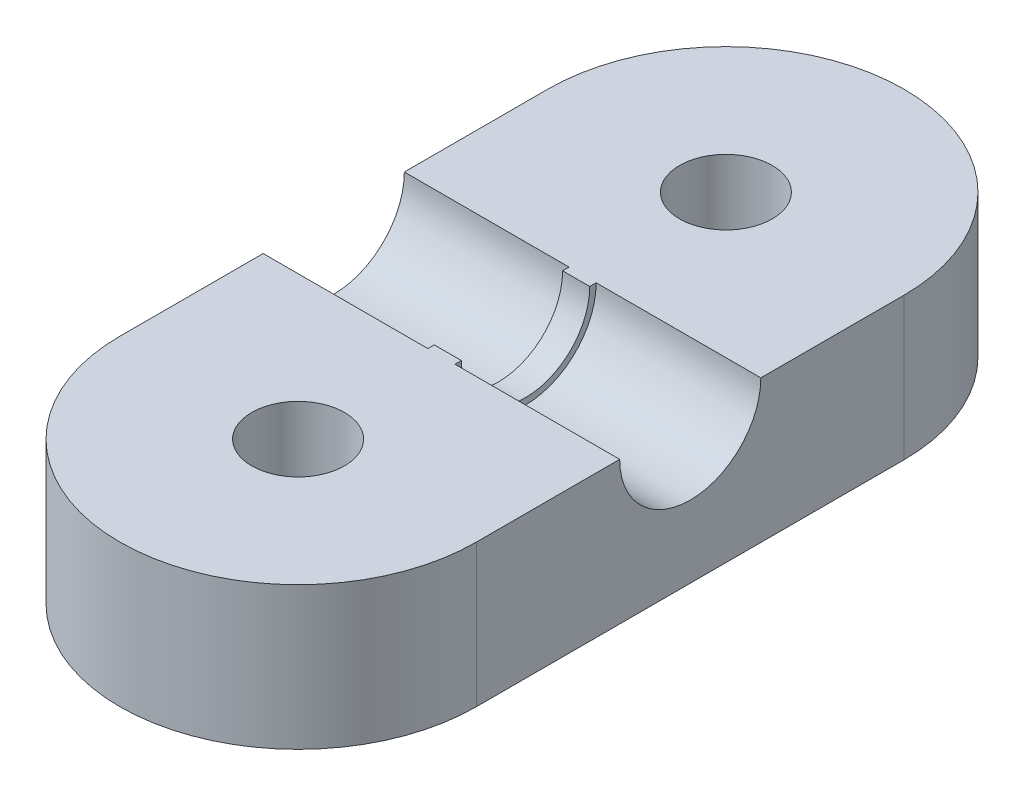
ISO-10303-21;
HEADER;
FILE_DESCRIPTION(('STEP AP214'),'2;1');
FILE_NAME('part.step','',(''),(''),'','','');
FILE_SCHEMA(('AUTOMOTIVE_DESIGN { 1 0 10303 214 1 1 1 1 }'));
ENDSEC;
DATA;
#1=APPLICATION_CONTEXT('core data for automotive mechanical design processes');
#2=APPLICATION_PROTOCOL_DEFINITION('international standard','automotive_design',2000,#1);
#3=PRODUCT_CONTEXT('',#1,'mechanical');
#4=PRODUCT('Part','Part','',(#3));
#5=PRODUCT_RELATED_PRODUCT_CATEGORY('part','',(#4));
#6=PRODUCT_DEFINITION_FORMATION('','',#4);
#7=PRODUCT_DEFINITION_CONTEXT('part definition',#1,'design');
#8=PRODUCT_DEFINITION('design','',#6,#7);
#9=PRODUCT_DEFINITION_SHAPE('','',#8);
#10=(LENGTH_UNIT() NAMED_UNIT(*) SI_UNIT(.MILLI.,.METRE.));
#11=(NAMED_UNIT(*) PLANE_ANGLE_UNIT() SI_UNIT($,.RADIAN.));
#12=(NAMED_UNIT(*) SI_UNIT($,.STERADIAN.) SOLID_ANGLE_UNIT());
#13=UNCERTAINTY_MEASURE_WITH_UNIT(LENGTH_MEASURE(1.E-05),#10,'distance_accuracy_value','');
#14=(GEOMETRIC_REPRESENTATION_CONTEXT(3) GLOBAL_UNCERTAINTY_ASSIGNED_CONTEXT((#13)) GLOBAL_UNIT_ASSIGNED_CONTEXT((#10,
#11,#12)) REPRESENTATION_CONTEXT('',''));
#15=CARTESIAN_POINT('',(0.,0.,0.));
#16=DIRECTION('',(0.,0.,1.));
#17=DIRECTION('',(1.,0.,0.));
#18=AXIS2_PLACEMENT_3D('',#15,#16,#17);
#19=CARTESIAN_POINT('',(-12.501,10.,0.));
#20=DIRECTION('',(1.,0.,0.));
#21=DIRECTION('',(0.,0.,-1.));
#22=AXIS2_PLACEMENT_3D('',#19,#20,#21);
#23=CYLINDRICAL_SURFACE('',#22,4.95);
#24=CARTESIAN_POINT('',(-0.95,10.,0.));
#25=DIRECTION('',(1.,0.,0.));
#26=DIRECTION('',(0.,0.,-1.));
#27=AXIS2_PLACEMENT_3D('',#24,#25,#26);
#28=CIRCLE('',#27,4.95);
#29=CARTESIAN_POINT('',(-0.95,10.,4.95));
#30=VERTEX_POINT('',#29);
#31=CARTESIAN_POINT('',(-0.95,10.,-4.95));
#32=VERTEX_POINT('',#31);
#33=EDGE_CURVE('E177',#30,#32,#28,.T.);
#34=ORIENTED_EDGE('',*,*,#33,.T.);
#35=DIRECTION('',(1.,0.,0.));
#36=VECTOR('',#35,1.);
#37=CARTESIAN_POINT('',(-12.501,10.,-4.95));
#38=LINE('',#37,#36);
#39=CARTESIAN_POINT('',(-12.5,10.,-4.95));
#40=VERTEX_POINT('',#39);
#41=EDGE_CURVE('E180',#40,#32,#38,.T.);
#42=ORIENTED_EDGE('',*,*,#41,.F.);
#43=CARTESIAN_POINT('',(-12.5,10.,0.));
#44=DIRECTION('',(1.,0.,0.));
#45=DIRECTION('',(0.,0.,-1.));
#46=AXIS2_PLACEMENT_3D('',#43,#44,#45);
#47=CIRCLE('',#46,4.95);
#48=CARTESIAN_POINT('',(-12.5,10.,4.95));
#49=VERTEX_POINT('',#48);
#50=EDGE_CURVE('E189',#40,#49,#47,.F.);
#51=ORIENTED_EDGE('',*,*,#50,.T.);
#52=DIRECTION('',(1.,0.,0.));
#53=VECTOR('',#52,1.);
#54=CARTESIAN_POINT('',(-12.501,10.,4.95));
#55=LINE('',#54,#53);
#56=EDGE_CURVE('E184',#30,#49,#55,.F.);
#57=ORIENTED_EDGE('',*,*,#56,.F.);
#58=EDGE_LOOP('',(#34,#42,#51,#57));
#59=FACE_BOUND('',#58,.T.);
#60=ADVANCED_FACE('F42',(#59),#23,.F.);
#61=CARTESIAN_POINT('',(0.,10.,0.));
#62=DIRECTION('',(0.,1.,0.));
#63=DIRECTION('',(0.,0.,1.));
#64=AXIS2_PLACEMENT_3D('',#61,#62,#63);
#65=PLANE('',#64);
#66=CARTESIAN_POINT('',(12.5,10.,4.95));
#67=VERTEX_POINT('',#66);
#68=CARTESIAN_POINT('',(0.95,10.,4.95));
#69=VERTEX_POINT('',#68);
#70=EDGE_CURVE('E163',#67,#69,#55,.F.);
#71=ORIENTED_EDGE('',*,*,#70,.T.);
#72=DIRECTION('',(0.,0.,-1.));
#73=VECTOR('',#72,1.);
#74=CARTESIAN_POINT('',(0.95,10.,0.));
#75=LINE('',#74,#73);
#76=CARTESIAN_POINT('',(0.95,10.,4.5));
#77=VERTEX_POINT('',#76);
#78=EDGE_CURVE('E154',#69,#77,#75,.T.);
#79=ORIENTED_EDGE('',*,*,#78,.T.);
#80=DIRECTION('',(-1.,0.,0.));
#81=VECTOR('',#80,1.);
#82=CARTESIAN_POINT('',(0.95,10.,4.5));
#83=LINE('',#82,#81);
#84=CARTESIAN_POINT('',(-0.95,10.,4.5));
#85=VERTEX_POINT('',#84);
#86=EDGE_CURVE('E137',#77,#85,#83,.T.);
#87=ORIENTED_EDGE('',*,*,#86,.T.);
#88=DIRECTION('',(0.,0.,-1.));
#89=VECTOR('',#88,1.);
#90=CARTESIAN_POINT('',(-0.95,10.,0.));
#91=LINE('',#90,#89);
#92=EDGE_CURVE('E280',#30,#85,#91,.T.);
#93=ORIENTED_EDGE('',*,*,#92,.F.);
#94=ORIENTED_EDGE('',*,*,#56,.T.);
#95=DIRECTION('',(0.,0.,1.));
#96=VECTOR('',#95,1.);
#97=CARTESIAN_POINT('',(-12.5,10.,0.));
#98=LINE('',#97,#96);
#99=CARTESIAN_POINT('',(-12.5,10.,15.));
#100=VERTEX_POINT('',#99);
#101=EDGE_CURVE('E199',#49,#100,#98,.T.);
#102=ORIENTED_EDGE('',*,*,#101,.T.);
#103=CARTESIAN_POINT('',(0.,10.,15.));
#104=DIRECTION('',(0.,1.,0.));
#105=DIRECTION('',(0.,0.,1.));
#106=AXIS2_PLACEMENT_3D('',#103,#104,#105);
#107=CIRCLE('',#106,12.5);
#108=CARTESIAN_POINT('',(12.5,10.,15.));
#109=VERTEX_POINT('',#108);
#110=EDGE_CURVE('E198',#109,#100,#107,.F.);
#111=ORIENTED_EDGE('',*,*,#110,.F.);
#112=DIRECTION('',(0.,0.,1.));
#113=VECTOR('',#112,1.);
#114=CARTESIAN_POINT('',(12.5,10.,0.));
#115=LINE('',#114,#113);
#116=EDGE_CURVE('E203',#67,#109,#115,.T.);
#117=ORIENTED_EDGE('',*,*,#116,.F.);
#118=EDGE_LOOP('',(#71,#79,#87,#93,#94,#102,#111,#117));
#119=FACE_BOUND('',#118,.T.);
#120=CARTESIAN_POINT('',(0.,10.,15.));
#121=DIRECTION('',(0.,1.,0.));
#122=DIRECTION('',(0.,0.,1.));
#123=AXIS2_PLACEMENT_3D('',#120,#121,#122);
#124=CIRCLE('',#123,3.25);
#125=CARTESIAN_POINT('',(0.,10.,18.25));
#126=VERTEX_POINT('',#125);
#127=EDGE_CURVE('E215',#126,#126,#124,.F.);
#128=ORIENTED_EDGE('',*,*,#127,.T.);
#129=EDGE_LOOP('',(#128));
#130=FACE_BOUND('',#129,.T.);
#131=ADVANCED_FACE('F160',(#119,#130),#65,.T.);
#132=CARTESIAN_POINT('',(-12.5,10.,0.));
#133=DIRECTION('',(1.,0.,0.));
#134=DIRECTION('',(0.,0.,-1.));
#135=AXIS2_PLACEMENT_3D('',#132,#133,#134);
#136=PLANE('',#135);
#137=ORIENTED_EDGE('',*,*,#101,.F.);
#138=ORIENTED_EDGE('',*,*,#50,.F.);
#139=CARTESIAN_POINT('',(-12.5,10.,-15.));
#140=VERTEX_POINT('',#139);
#141=EDGE_CURVE('E194',#140,#40,#98,.T.);
#142=ORIENTED_EDGE('',*,*,#141,.F.);
#143=DIRECTION('',(0.,-1.,0.));
#144=VECTOR('',#143,1.);
#145=CARTESIAN_POINT('',(-12.5,10.,-15.));
#146=LINE('',#145,#144);
#147=CARTESIAN_POINT('',(-12.5,0.,-15.));
#148=VERTEX_POINT('',#147);
#149=EDGE_CURVE('E219',#140,#148,#146,.T.);
#150=ORIENTED_EDGE('',*,*,#149,.T.);
#151=DIRECTION('',(0.,0.,1.));
#152=VECTOR('',#151,1.);
#153=CARTESIAN_POINT('',(-12.5,0.,0.));
#154=LINE('',#153,#152);
#155=CARTESIAN_POINT('',(-12.5,0.,15.));
#156=VERTEX_POINT('',#155);
#157=EDGE_CURVE('E193',#148,#156,#154,.T.);
#158=ORIENTED_EDGE('',*,*,#157,.T.);
#159=DIRECTION('',(0.,-1.,0.));
#160=VECTOR('',#159,1.);
#161=CARTESIAN_POINT('',(-12.5,10.,15.));
#162=LINE('',#161,#160);
#163=EDGE_CURVE('E11',#100,#156,#162,.T.);
#164=ORIENTED_EDGE('',*,*,#163,.F.);
#165=EDGE_LOOP('',(#137,#138,#142,#150,#158,#164));
#166=FACE_BOUND('',#165,.T.);
#167=ADVANCED_FACE('F44',(#166),#136,.F.);
#168=CARTESIAN_POINT('',(0.,10.,15.));
#169=DIRECTION('',(0.,-1.,0.));
#170=DIRECTION('',(0.,0.,-1.));
#171=AXIS2_PLACEMENT_3D('',#168,#169,#170);
#172=CYLINDRICAL_SURFACE('',#171,12.5);
#173=CARTESIAN_POINT('',(0.,0.,15.));
#174=DIRECTION('',(0.,1.,0.));
#175=DIRECTION('',(0.,0.,1.));
#176=AXIS2_PLACEMENT_3D('',#173,#174,#175);
#177=CIRCLE('',#176,12.5);
#178=CARTESIAN_POINT('',(12.5,0.,15.));
#179=VERTEX_POINT('',#178);
#180=EDGE_CURVE('E223',#179,#156,#177,.F.);
#181=ORIENTED_EDGE('',*,*,#180,.F.);
#182=DIRECTION('',(0.,-1.,0.));
#183=VECTOR('',#182,1.);
#184=CARTESIAN_POINT('',(12.5,10.,15.));
#185=LINE('',#184,#183);
#186=EDGE_CURVE('E51',#109,#179,#185,.T.);
#187=ORIENTED_EDGE('',*,*,#186,.F.);
#188=ORIENTED_EDGE('',*,*,#110,.T.);
#189=ORIENTED_EDGE('',*,*,#163,.T.);
#190=EDGE_LOOP('',(#181,#187,#188,#189));
#191=FACE_BOUND('',#190,.T.);
#192=ADVANCED_FACE('F256',(#191),#172,.T.);
#193=CARTESIAN_POINT('',(12.5,10.,0.));
#194=DIRECTION('',(1.,0.,0.));
#195=DIRECTION('',(0.,0.,-1.));
#196=AXIS2_PLACEMENT_3D('',#193,#194,#195);
#197=PLANE('',#196);
#198=CARTESIAN_POINT('',(12.5,10.,0.));
#199=DIRECTION('',(1.,0.,0.));
#200=DIRECTION('',(0.,0.,-1.));
#201=AXIS2_PLACEMENT_3D('',#198,#199,#200);
#202=CIRCLE('',#201,4.95);
#203=CARTESIAN_POINT('',(12.5,10.,-4.95));
#204=VERTEX_POINT('',#203);
#205=EDGE_CURVE('E186',#67,#204,#202,.T.);
#206=ORIENTED_EDGE('',*,*,#205,.F.);
#207=ORIENTED_EDGE('',*,*,#116,.T.);
#208=ORIENTED_EDGE('',*,*,#186,.T.);
#209=DIRECTION('',(0.,0.,1.));
#210=VECTOR('',#209,1.);
#211=CARTESIAN_POINT('',(12.5,0.,0.));
#212=LINE('',#211,#210);
#213=CARTESIAN_POINT('',(12.5,0.,-15.));
#214=VERTEX_POINT('',#213);
#215=EDGE_CURVE('E227',#214,#179,#212,.T.);
#216=ORIENTED_EDGE('',*,*,#215,.F.);
#217=DIRECTION('',(0.,-1.,0.));
#218=VECTOR('',#217,1.);
#219=CARTESIAN_POINT('',(12.5,10.,-15.));
#220=LINE('',#219,#218);
#221=CARTESIAN_POINT('',(12.5,10.,-15.));
#222=VERTEX_POINT('',#221);
#223=EDGE_CURVE('E245',#222,#214,#220,.T.);
#224=ORIENTED_EDGE('',*,*,#223,.F.);
#225=EDGE_CURVE('E204',#222,#204,#115,.T.);
#226=ORIENTED_EDGE('',*,*,#225,.T.);
#227=EDGE_LOOP('',(#206,#207,#208,#216,#224,#226));
#228=FACE_BOUND('',#227,.T.);
#229=ADVANCED_FACE('F253',(#228),#197,.T.);
#230=CARTESIAN_POINT('',(0.,10.,-15.));
#231=DIRECTION('',(0.,-1.,0.));
#232=DIRECTION('',(0.,0.,-1.));
#233=AXIS2_PLACEMENT_3D('',#230,#231,#232);
#234=CYLINDRICAL_SURFACE('',#233,3.25);
#235=CARTESIAN_POINT('',(0.,10.,-15.));
#236=DIRECTION('',(0.,1.,0.));
#237=DIRECTION('',(0.,0.,1.));
#238=AXIS2_PLACEMENT_3D('',#235,#236,#237);
#239=CIRCLE('',#238,3.25);
#240=CARTESIAN_POINT('',(0.,10.,-11.75));
#241=VERTEX_POINT('',#240);
#242=EDGE_CURVE('E211',#241,#241,#239,.T.);
#243=ORIENTED_EDGE('',*,*,#242,.T.);
#244=EDGE_LOOP('',(#243));
#245=FACE_BOUND('',#244,.T.);
#246=CARTESIAN_POINT('',(0.,0.,-15.));
#247=DIRECTION('',(0.,1.,0.));
#248=DIRECTION('',(0.,0.,1.));
#249=AXIS2_PLACEMENT_3D('',#246,#247,#248);
#250=CIRCLE('',#249,3.25);
#251=CARTESIAN_POINT('',(0.,0.,-11.75));
#252=VERTEX_POINT('',#251);
#253=EDGE_CURVE('E234',#252,#252,#250,.T.);
#254=ORIENTED_EDGE('',*,*,#253,.F.);
#255=EDGE_LOOP('',(#254));
#256=FACE_BOUND('',#255,.T.);
#257=ADVANCED_FACE('F309',(#245,#256),#234,.F.);
#258=CARTESIAN_POINT('',(0.,10.,-15.));
#259=DIRECTION('',(0.,-1.,0.));
#260=DIRECTION('',(0.,0.,-1.));
#261=AXIS2_PLACEMENT_3D('',#258,#259,#260);
#262=CYLINDRICAL_SURFACE('',#261,12.5);
#263=CARTESIAN_POINT('',(0.,0.,-15.));
#264=DIRECTION('',(0.,1.,0.));
#265=DIRECTION('',(0.,0.,1.));
#266=AXIS2_PLACEMENT_3D('',#263,#264,#265);
#267=CIRCLE('',#266,12.5);
#268=EDGE_CURVE('E231',#214,#148,#267,.T.);
#269=ORIENTED_EDGE('',*,*,#268,.T.);
#270=ORIENTED_EDGE('',*,*,#149,.F.);
#271=CARTESIAN_POINT('',(0.,10.,-15.));
#272=DIRECTION('',(0.,1.,0.));
#273=DIRECTION('',(0.,0.,1.));
#274=AXIS2_PLACEMENT_3D('',#271,#272,#273);
#275=CIRCLE('',#274,12.5);
#276=EDGE_CURVE('E208',#222,#140,#275,.T.);
#277=ORIENTED_EDGE('',*,*,#276,.F.);
#278=ORIENTED_EDGE('',*,*,#223,.T.);
#279=EDGE_LOOP('',(#269,#270,#277,#278));
#280=FACE_BOUND('',#279,.T.);
#281=ADVANCED_FACE('F265',(#280),#262,.T.);
#282=CARTESIAN_POINT('',(0.,10.,15.));
#283=DIRECTION('',(0.,-1.,0.));
#284=DIRECTION('',(0.,0.,-1.));
#285=AXIS2_PLACEMENT_3D('',#282,#283,#284);
#286=CYLINDRICAL_SURFACE('',#285,3.25);
#287=ORIENTED_EDGE('',*,*,#127,.F.);
#288=EDGE_LOOP('',(#287));
#289=FACE_BOUND('',#288,.T.);
#290=CARTESIAN_POINT('',(0.,0.,15.));
#291=DIRECTION('',(0.,1.,0.));
#292=DIRECTION('',(0.,0.,1.));
#293=AXIS2_PLACEMENT_3D('',#290,#291,#292);
#294=CIRCLE('',#293,3.25);
#295=CARTESIAN_POINT('',(0.,0.,18.25));
#296=VERTEX_POINT('',#295);
#297=EDGE_CURVE('E238',#296,#296,#294,.F.);
#298=ORIENTED_EDGE('',*,*,#297,.T.);
#299=EDGE_LOOP('',(#298));
#300=FACE_BOUND('',#299,.T.);
#301=ADVANCED_FACE('F304',(#289,#300),#286,.F.);
#302=ORIENTED_EDGE('',*,*,#41,.T.);
#303=CARTESIAN_POINT('',(-0.95,10.,-4.5));
#304=VERTEX_POINT('',#303);
#305=EDGE_CURVE('E158',#304,#32,#91,.T.);
#306=ORIENTED_EDGE('',*,*,#305,.F.);
#307=DIRECTION('',(-1.,0.,0.));
#308=VECTOR('',#307,1.);
#309=CARTESIAN_POINT('',(0.95,10.,-4.5));
#310=LINE('',#309,#308);
#311=CARTESIAN_POINT('',(0.95,10.,-4.5));
#312=VERTEX_POINT('',#311);
#313=EDGE_CURVE('E149',#312,#304,#310,.T.);
#314=ORIENTED_EDGE('',*,*,#313,.F.);
#315=CARTESIAN_POINT('',(0.95,10.,-4.95));
#316=VERTEX_POINT('',#315);
#317=EDGE_CURVE('E156',#312,#316,#75,.T.);
#318=ORIENTED_EDGE('',*,*,#317,.T.);
#319=EDGE_CURVE('E69',#316,#204,#38,.T.);
#320=ORIENTED_EDGE('',*,*,#319,.T.);
#321=ORIENTED_EDGE('',*,*,#225,.F.);
#322=ORIENTED_EDGE('',*,*,#276,.T.);
#323=ORIENTED_EDGE('',*,*,#141,.T.);
#324=EDGE_LOOP('',(#302,#306,#314,#318,#320,#321,#322,#323));
#325=FACE_BOUND('',#324,.T.);
#326=ORIENTED_EDGE('',*,*,#242,.F.);
#327=EDGE_LOOP('',(#326));
#328=FACE_BOUND('',#327,.T.);
#329=ADVANCED_FACE('F271',(#325,#328),#65,.T.);
#330=CARTESIAN_POINT('',(0.,0.,0.));
#331=DIRECTION('',(0.,1.,0.));
#332=DIRECTION('',(0.,0.,1.));
#333=AXIS2_PLACEMENT_3D('',#330,#331,#332);
#334=PLANE('',#333);
#335=ORIENTED_EDGE('',*,*,#157,.F.);
#336=ORIENTED_EDGE('',*,*,#268,.F.);
#337=ORIENTED_EDGE('',*,*,#215,.T.);
#338=ORIENTED_EDGE('',*,*,#180,.T.);
#339=EDGE_LOOP('',(#335,#336,#337,#338));
#340=FACE_BOUND('',#339,.T.);
#341=ORIENTED_EDGE('',*,*,#253,.T.);
#342=EDGE_LOOP('',(#341));
#343=FACE_BOUND('',#342,.T.);
#344=ORIENTED_EDGE('',*,*,#297,.F.);
#345=EDGE_LOOP('',(#344));
#346=FACE_BOUND('',#345,.T.);
#347=ADVANCED_FACE('F261',(#340,#343,#346),#334,.F.);
#348=ORIENTED_EDGE('',*,*,#319,.F.);
#349=CARTESIAN_POINT('',(0.95,10.,0.));
#350=DIRECTION('',(1.,0.,0.));
#351=DIRECTION('',(0.,0.,-1.));
#352=AXIS2_PLACEMENT_3D('',#349,#350,#351);
#353=CIRCLE('',#352,4.95);
#354=EDGE_CURVE('E61',#69,#316,#353,.T.);
#355=ORIENTED_EDGE('',*,*,#354,.F.);
#356=ORIENTED_EDGE('',*,*,#70,.F.);
#357=ORIENTED_EDGE('',*,*,#205,.T.);
#358=EDGE_LOOP('',(#348,#355,#356,#357));
#359=FACE_BOUND('',#358,.T.);
#360=ADVANCED_FACE('F289',(#359),#23,.F.);
#361=CARTESIAN_POINT('',(0.95,10.,0.));
#362=DIRECTION('',(-1.,0.,0.));
#363=DIRECTION('',(0.,0.,1.));
#364=AXIS2_PLACEMENT_3D('',#361,#362,#363);
#365=CYLINDRICAL_SURFACE('',#364,4.5);
#366=CARTESIAN_POINT('',(-0.95,10.,0.));
#367=DIRECTION('',(1.,0.,0.));
#368=DIRECTION('',(0.,0.,-1.));
#369=AXIS2_PLACEMENT_3D('',#366,#367,#368);
#370=CIRCLE('',#369,4.5);
#371=EDGE_CURVE('E143',#85,#304,#370,.T.);
#372=ORIENTED_EDGE('',*,*,#371,.F.);
#373=ORIENTED_EDGE('',*,*,#86,.F.);
#374=CARTESIAN_POINT('',(0.95,10.,0.));
#375=DIRECTION('',(1.,0.,0.));
#376=DIRECTION('',(0.,0.,-1.));
#377=AXIS2_PLACEMENT_3D('',#374,#375,#376);
#378=CIRCLE('',#377,4.5);
#379=EDGE_CURVE('E140',#77,#312,#378,.T.);
#380=ORIENTED_EDGE('',*,*,#379,.T.);
#381=ORIENTED_EDGE('',*,*,#313,.T.);
#382=EDGE_LOOP('',(#372,#373,#380,#381));
#383=FACE_BOUND('',#382,.T.);
#384=ADVANCED_FACE('F139',(#383),#365,.F.);
#385=CARTESIAN_POINT('',(0.95,0.,0.));
#386=DIRECTION('',(1.,0.,0.));
#387=DIRECTION('',(0.,0.,-1.));
#388=AXIS2_PLACEMENT_3D('',#385,#386,#387);
#389=PLANE('',#388);
#390=ORIENTED_EDGE('',*,*,#379,.F.);
#391=ORIENTED_EDGE('',*,*,#78,.F.);
#392=ORIENTED_EDGE('',*,*,#354,.T.);
#393=ORIENTED_EDGE('',*,*,#317,.F.);
#394=EDGE_LOOP('',(#390,#391,#392,#393));
#395=FACE_BOUND('',#394,.T.);
#396=ADVANCED_FACE('F153',(#395),#389,.T.);
#397=CARTESIAN_POINT('',(-0.95,0.,0.));
#398=DIRECTION('',(1.,0.,0.));
#399=DIRECTION('',(0.,0.,-1.));
#400=AXIS2_PLACEMENT_3D('',#397,#398,#399);
#401=PLANE('',#400);
#402=ORIENTED_EDGE('',*,*,#371,.T.);
#403=ORIENTED_EDGE('',*,*,#305,.T.);
#404=ORIENTED_EDGE('',*,*,#33,.F.);
#405=ORIENTED_EDGE('',*,*,#92,.T.);
#406=EDGE_LOOP('',(#402,#403,#404,#405));
#407=FACE_BOUND('',#406,.T.);
#408=ADVANCED_FACE('F285',(#407),#401,.F.);
#409=CLOSED_SHELL('',(#60,#131,#167,#192,#229,#257,#281,#301,#329,#347,#360,#384,#396,#408));
#410=MANIFOLD_SOLID_BREP('B2',#409);
#411=ADVANCED_BREP_SHAPE_REPRESENTATION('',(#18,#410),#14);
#412=SHAPE_DEFINITION_REPRESENTATION(#9,#411);
ENDSEC;
END-ISO-10303-21;
